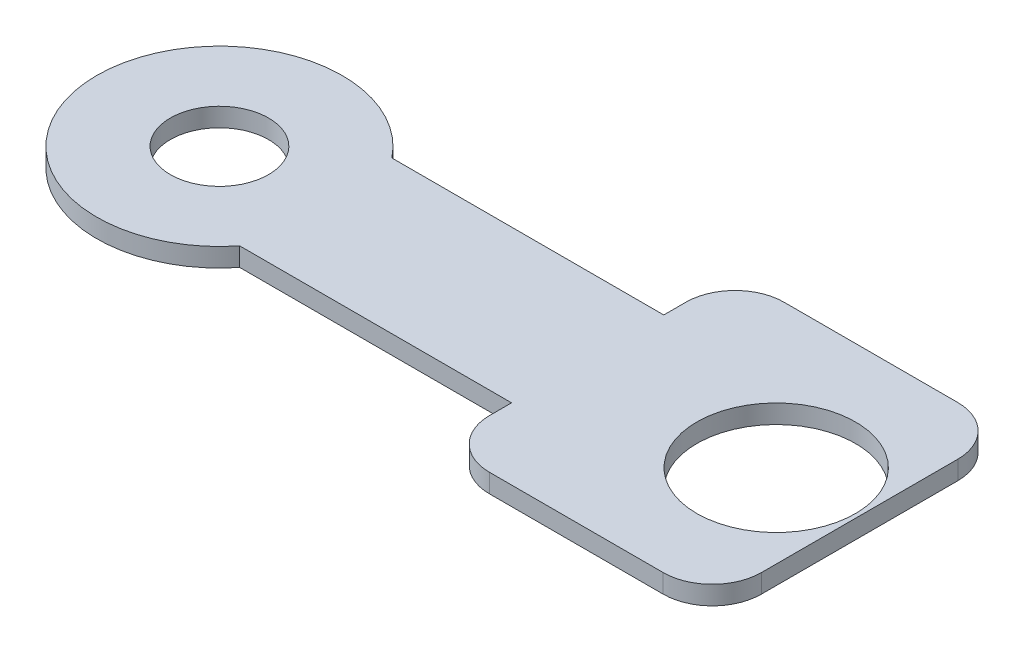
ISO-10303-21;
HEADER;
FILE_DESCRIPTION(('STEP AP214'),'2;1');
FILE_NAME('part.step','',(''),(''),'','','');
FILE_SCHEMA(('AUTOMOTIVE_DESIGN { 1 0 10303 214 1 1 1 1 }'));
ENDSEC;
DATA;
#1=APPLICATION_CONTEXT('core data for automotive mechanical design processes');
#2=APPLICATION_PROTOCOL_DEFINITION('international standard','automotive_design',2000,#1);
#3=PRODUCT_CONTEXT('',#1,'mechanical');
#4=PRODUCT('Part','Part','',(#3));
#5=PRODUCT_RELATED_PRODUCT_CATEGORY('part','',(#4));
#6=PRODUCT_DEFINITION_FORMATION('','',#4);
#7=PRODUCT_DEFINITION_CONTEXT('part definition',#1,'design');
#8=PRODUCT_DEFINITION('design','',#6,#7);
#9=PRODUCT_DEFINITION_SHAPE('','',#8);
#10=(LENGTH_UNIT() NAMED_UNIT(*) SI_UNIT(.MILLI.,.METRE.));
#11=(NAMED_UNIT(*) PLANE_ANGLE_UNIT() SI_UNIT($,.RADIAN.));
#12=(NAMED_UNIT(*) SI_UNIT($,.STERADIAN.) SOLID_ANGLE_UNIT());
#13=UNCERTAINTY_MEASURE_WITH_UNIT(LENGTH_MEASURE(1.E-05),#10,'distance_accuracy_value','');
#14=(GEOMETRIC_REPRESENTATION_CONTEXT(3) GLOBAL_UNCERTAINTY_ASSIGNED_CONTEXT((#13)) GLOBAL_UNIT_ASSIGNED_CONTEXT((#10,
#11,#12)) REPRESENTATION_CONTEXT('',''));
#15=CARTESIAN_POINT('',(0.,0.,0.));
#16=DIRECTION('',(0.,0.,1.));
#17=DIRECTION('',(1.,0.,0.));
#18=AXIS2_PLACEMENT_3D('',#15,#16,#17);
#19=CARTESIAN_POINT('',(0.,0.381,-1.55));
#20=DIRECTION('',(0.,0.,1.));
#21=DIRECTION('',(1.,0.,0.));
#22=AXIS2_PLACEMENT_3D('',#19,#20,#21);
#23=PLANE('',#22);
#24=DIRECTION('',(-1.,0.,0.));
#25=VECTOR('',#24,1.);
#26=CARTESIAN_POINT('',(0.,0.,-1.55));
#27=LINE('',#26,#25);
#28=CARTESIAN_POINT('',(10.,0.,-1.55));
#29=VERTEX_POINT('',#28);
#30=CARTESIAN_POINT('',(4.4615045245933,0.,-1.55));
#31=VERTEX_POINT('',#30);
#32=EDGE_CURVE('E165',#29,#31,#27,.T.);
#33=ORIENTED_EDGE('',*,*,#32,.T.);
#34=DIRECTION('',(0.,-1.,0.));
#35=VECTOR('',#34,1.);
#36=CARTESIAN_POINT('',(4.4615045245933,0.381,-1.55));
#37=LINE('',#36,#35);
#38=CARTESIAN_POINT('',(4.4615045245933,0.381,-1.55));
#39=VERTEX_POINT('',#38);
#40=EDGE_CURVE('E11',#39,#31,#37,.T.);
#41=ORIENTED_EDGE('',*,*,#40,.F.);
#42=DIRECTION('',(-1.,0.,0.));
#43=VECTOR('',#42,1.);
#44=CARTESIAN_POINT('',(0.,0.381,-1.55));
#45=LINE('',#44,#43);
#46=CARTESIAN_POINT('',(10.,0.381,-1.55));
#47=VERTEX_POINT('',#46);
#48=EDGE_CURVE('E234',#47,#39,#45,.T.);
#49=ORIENTED_EDGE('',*,*,#48,.F.);
#50=DIRECTION('',(0.,-1.,0.));
#51=VECTOR('',#50,1.);
#52=CARTESIAN_POINT('',(10.,0.381,-1.55));
#53=LINE('',#52,#51);
#54=EDGE_CURVE('E53',#47,#29,#53,.T.);
#55=ORIENTED_EDGE('',*,*,#54,.T.);
#56=EDGE_LOOP('',(#33,#41,#49,#55));
#57=FACE_BOUND('',#56,.T.);
#58=ADVANCED_FACE('F36',(#57),#23,.F.);
#59=CARTESIAN_POINT('',(2.5,0.381,0.));
#60=DIRECTION('',(0.,-1.,0.));
#61=DIRECTION('',(0.,0.,-1.));
#62=AXIS2_PLACEMENT_3D('',#59,#60,#61);
#63=CYLINDRICAL_SURFACE('',#62,2.5);
#64=CARTESIAN_POINT('',(2.5,0.,0.));
#65=DIRECTION('',(0.,1.,0.));
#66=DIRECTION('',(0.,0.,1.));
#67=AXIS2_PLACEMENT_3D('',#64,#65,#66);
#68=CIRCLE('',#67,2.5);
#69=CARTESIAN_POINT('',(4.4615045245933,0.,1.55));
#70=VERTEX_POINT('',#69);
#71=EDGE_CURVE('E167',#31,#70,#68,.T.);
#72=ORIENTED_EDGE('',*,*,#71,.T.);
#73=DIRECTION('',(0.,-1.,0.));
#74=VECTOR('',#73,1.);
#75=CARTESIAN_POINT('',(4.4615045245933,0.381,1.55));
#76=LINE('',#75,#74);
#77=CARTESIAN_POINT('',(4.4615045245933,0.381,1.55));
#78=VERTEX_POINT('',#77);
#79=EDGE_CURVE('E45',#78,#70,#76,.T.);
#80=ORIENTED_EDGE('',*,*,#79,.F.);
#81=CARTESIAN_POINT('',(2.5,0.381,0.));
#82=DIRECTION('',(0.,1.,0.));
#83=DIRECTION('',(0.,0.,1.));
#84=AXIS2_PLACEMENT_3D('',#81,#82,#83);
#85=CIRCLE('',#84,2.5);
#86=EDGE_CURVE('E103',#39,#78,#85,.T.);
#87=ORIENTED_EDGE('',*,*,#86,.F.);
#88=ORIENTED_EDGE('',*,*,#40,.T.);
#89=EDGE_LOOP('',(#72,#80,#87,#88));
#90=FACE_BOUND('',#89,.T.);
#91=ADVANCED_FACE('F219',(#90),#63,.T.);
#92=CARTESIAN_POINT('',(0.,0.381,1.55));
#93=DIRECTION('',(0.,0.,1.));
#94=DIRECTION('',(1.,0.,0.));
#95=AXIS2_PLACEMENT_3D('',#92,#93,#94);
#96=PLANE('',#95);
#97=DIRECTION('',(-1.,0.,0.));
#98=VECTOR('',#97,1.);
#99=CARTESIAN_POINT('',(0.,0.,1.55));
#100=LINE('',#99,#98);
#101=CARTESIAN_POINT('',(10.,0.,1.55));
#102=VERTEX_POINT('',#101);
#103=EDGE_CURVE('E170',#102,#70,#100,.T.);
#104=ORIENTED_EDGE('',*,*,#103,.F.);
#105=DIRECTION('',(0.,-1.,0.));
#106=VECTOR('',#105,1.);
#107=CARTESIAN_POINT('',(10.,0.381,1.55));
#108=LINE('',#107,#106);
#109=CARTESIAN_POINT('',(10.,0.381,1.55));
#110=VERTEX_POINT('',#109);
#111=EDGE_CURVE('E212',#110,#102,#108,.T.);
#112=ORIENTED_EDGE('',*,*,#111,.F.);
#113=DIRECTION('',(-1.,0.,0.));
#114=VECTOR('',#113,1.);
#115=CARTESIAN_POINT('',(0.,0.381,1.55));
#116=LINE('',#115,#114);
#117=EDGE_CURVE('E218',#110,#78,#116,.T.);
#118=ORIENTED_EDGE('',*,*,#117,.T.);
#119=ORIENTED_EDGE('',*,*,#79,.T.);
#120=EDGE_LOOP('',(#104,#112,#118,#119));
#121=FACE_BOUND('',#120,.T.);
#122=ADVANCED_FACE('F216',(#121),#96,.T.);
#123=CARTESIAN_POINT('',(10.,0.381,0.));
#124=DIRECTION('',(-1.,0.,0.));
#125=DIRECTION('',(0.,0.,1.));
#126=AXIS2_PLACEMENT_3D('',#123,#124,#125);
#127=PLANE('',#126);
#128=DIRECTION('',(0.,0.,-1.));
#129=VECTOR('',#128,1.);
#130=CARTESIAN_POINT('',(10.,0.,0.));
#131=LINE('',#130,#129);
#132=CARTESIAN_POINT('',(10.,0.,1.99999999999999));
#133=VERTEX_POINT('',#132);
#134=EDGE_CURVE('E173',#133,#102,#131,.T.);
#135=ORIENTED_EDGE('',*,*,#134,.F.);
#136=DIRECTION('',(0.,-1.,0.));
#137=VECTOR('',#136,1.);
#138=CARTESIAN_POINT('',(10.,0.381,1.99999999999999));
#139=LINE('',#138,#137);
#140=CARTESIAN_POINT('',(10.,0.381,1.99999999999999));
#141=VERTEX_POINT('',#140);
#142=EDGE_CURVE('E210',#141,#133,#139,.T.);
#143=ORIENTED_EDGE('',*,*,#142,.F.);
#144=DIRECTION('',(0.,0.,-1.));
#145=VECTOR('',#144,1.);
#146=CARTESIAN_POINT('',(10.,0.381,0.));
#147=LINE('',#146,#145);
#148=EDGE_CURVE('E157',#141,#110,#147,.T.);
#149=ORIENTED_EDGE('',*,*,#148,.T.);
#150=ORIENTED_EDGE('',*,*,#111,.T.);
#151=EDGE_LOOP('',(#135,#143,#149,#150));
#152=FACE_BOUND('',#151,.T.);
#153=ADVANCED_FACE('F228',(#152),#127,.T.);
#154=CARTESIAN_POINT('',(11.,0.381,2.));
#155=DIRECTION('',(0.,-1.,0.));
#156=DIRECTION('',(0.,0.,-1.));
#157=AXIS2_PLACEMENT_3D('',#154,#155,#156);
#158=CYLINDRICAL_SURFACE('',#157,1.);
#159=CARTESIAN_POINT('',(11.,0.,2.));
#160=DIRECTION('',(0.,1.,0.));
#161=DIRECTION('',(0.,0.,1.));
#162=AXIS2_PLACEMENT_3D('',#159,#160,#161);
#163=CIRCLE('',#162,1.);
#164=CARTESIAN_POINT('',(11.,0.,3.));
#165=VERTEX_POINT('',#164);
#166=EDGE_CURVE('E176',#133,#165,#163,.T.);
#167=ORIENTED_EDGE('',*,*,#166,.T.);
#168=DIRECTION('',(0.,-1.,0.));
#169=VECTOR('',#168,1.);
#170=CARTESIAN_POINT('',(11.,0.381,3.));
#171=LINE('',#170,#169);
#172=CARTESIAN_POINT('',(11.,0.381,3.));
#173=VERTEX_POINT('',#172);
#174=EDGE_CURVE('E207',#173,#165,#171,.T.);
#175=ORIENTED_EDGE('',*,*,#174,.F.);
#176=CARTESIAN_POINT('',(11.,0.381,2.));
#177=DIRECTION('',(0.,1.,0.));
#178=DIRECTION('',(0.,0.,1.));
#179=AXIS2_PLACEMENT_3D('',#176,#177,#178);
#180=CIRCLE('',#179,1.);
#181=EDGE_CURVE('E233',#141,#173,#180,.T.);
#182=ORIENTED_EDGE('',*,*,#181,.F.);
#183=ORIENTED_EDGE('',*,*,#142,.T.);
#184=EDGE_LOOP('',(#167,#175,#182,#183));
#185=FACE_BOUND('',#184,.T.);
#186=ADVANCED_FACE('F267',(#185),#158,.T.);
#187=CARTESIAN_POINT('',(0.,0.381,3.));
#188=DIRECTION('',(0.,0.,-1.));
#189=DIRECTION('',(-1.,0.,0.));
#190=AXIS2_PLACEMENT_3D('',#187,#188,#189);
#191=PLANE('',#190);
#192=DIRECTION('',(1.,0.,0.));
#193=VECTOR('',#192,1.);
#194=CARTESIAN_POINT('',(0.,0.,3.));
#195=LINE('',#194,#193);
#196=CARTESIAN_POINT('',(14.5384954754067,0.,3.));
#197=VERTEX_POINT('',#196);
#198=EDGE_CURVE('E179',#165,#197,#195,.T.);
#199=ORIENTED_EDGE('',*,*,#198,.T.);
#200=DIRECTION('',(0.,-1.,0.));
#201=VECTOR('',#200,1.);
#202=CARTESIAN_POINT('',(14.5384954754067,0.381,3.));
#203=LINE('',#202,#201);
#204=CARTESIAN_POINT('',(14.5384954754067,0.381,3.));
#205=VERTEX_POINT('',#204);
#206=EDGE_CURVE('E205',#205,#197,#203,.T.);
#207=ORIENTED_EDGE('',*,*,#206,.F.);
#208=DIRECTION('',(1.,0.,0.));
#209=VECTOR('',#208,1.);
#210=CARTESIAN_POINT('',(0.,0.381,3.));
#211=LINE('',#210,#209);
#212=EDGE_CURVE('E239',#173,#205,#211,.T.);
#213=ORIENTED_EDGE('',*,*,#212,.F.);
#214=ORIENTED_EDGE('',*,*,#174,.T.);
#215=EDGE_LOOP('',(#199,#207,#213,#214));
#216=FACE_BOUND('',#215,.T.);
#217=ADVANCED_FACE('F278',(#216),#191,.F.);
#218=CARTESIAN_POINT('',(14.5384954754067,0.381,2.));
#219=DIRECTION('',(0.,-1.,0.));
#220=DIRECTION('',(0.,0.,-1.));
#221=AXIS2_PLACEMENT_3D('',#218,#219,#220);
#222=CYLINDRICAL_SURFACE('',#221,1.);
#223=CARTESIAN_POINT('',(14.5384954754067,0.,2.));
#224=DIRECTION('',(0.,1.,0.));
#225=DIRECTION('',(0.,0.,1.));
#226=AXIS2_PLACEMENT_3D('',#223,#224,#225);
#227=CIRCLE('',#226,1.);
#228=CARTESIAN_POINT('',(15.5384954754067,0.,1.99999999999999));
#229=VERTEX_POINT('',#228);
#230=EDGE_CURVE('E182',#229,#197,#227,.F.);
#231=ORIENTED_EDGE('',*,*,#230,.F.);
#232=DIRECTION('',(0.,-1.,0.));
#233=VECTOR('',#232,1.);
#234=CARTESIAN_POINT('',(15.5384954754067,0.381,1.99999999999999));
#235=LINE('',#234,#233);
#236=CARTESIAN_POINT('',(15.5384954754067,0.381,1.99999999999999));
#237=VERTEX_POINT('',#236);
#238=EDGE_CURVE('E203',#237,#229,#235,.T.);
#239=ORIENTED_EDGE('',*,*,#238,.F.);
#240=CARTESIAN_POINT('',(14.5384954754067,0.381,2.));
#241=DIRECTION('',(0.,1.,0.));
#242=DIRECTION('',(0.,0.,1.));
#243=AXIS2_PLACEMENT_3D('',#240,#241,#242);
#244=CIRCLE('',#243,1.);
#245=EDGE_CURVE('E241',#237,#205,#244,.F.);
#246=ORIENTED_EDGE('',*,*,#245,.T.);
#247=ORIENTED_EDGE('',*,*,#206,.T.);
#248=EDGE_LOOP('',(#231,#239,#246,#247));
#249=FACE_BOUND('',#248,.T.);
#250=ADVANCED_FACE('F282',(#249),#222,.T.);
#251=CARTESIAN_POINT('',(15.5384954754067,0.381,0.));
#252=DIRECTION('',(-1.,0.,0.));
#253=DIRECTION('',(0.,0.,1.));
#254=AXIS2_PLACEMENT_3D('',#251,#252,#253);
#255=PLANE('',#254);
#256=DIRECTION('',(0.,0.,-1.));
#257=VECTOR('',#256,1.);
#258=CARTESIAN_POINT('',(15.5384954754067,0.,0.));
#259=LINE('',#258,#257);
#260=CARTESIAN_POINT('',(15.5384954754067,0.,-1.99999999999999));
#261=VERTEX_POINT('',#260);
#262=EDGE_CURVE('E185',#229,#261,#259,.T.);
#263=ORIENTED_EDGE('',*,*,#262,.T.);
#264=DIRECTION('',(0.,-1.,0.));
#265=VECTOR('',#264,1.);
#266=CARTESIAN_POINT('',(15.5384954754067,0.381,-1.99999999999999));
#267=LINE('',#266,#265);
#268=CARTESIAN_POINT('',(15.5384954754067,0.381,-1.99999999999999));
#269=VERTEX_POINT('',#268);
#270=EDGE_CURVE('E200',#269,#261,#267,.T.);
#271=ORIENTED_EDGE('',*,*,#270,.F.);
#272=DIRECTION('',(0.,0.,-1.));
#273=VECTOR('',#272,1.);
#274=CARTESIAN_POINT('',(15.5384954754067,0.381,0.));
#275=LINE('',#274,#273);
#276=EDGE_CURVE('E244',#237,#269,#275,.T.);
#277=ORIENTED_EDGE('',*,*,#276,.F.);
#278=ORIENTED_EDGE('',*,*,#238,.T.);
#279=EDGE_LOOP('',(#263,#271,#277,#278));
#280=FACE_BOUND('',#279,.T.);
#281=ADVANCED_FACE('F249',(#280),#255,.F.);
#282=CARTESIAN_POINT('',(14.5384954754067,0.381,-2.));
#283=DIRECTION('',(0.,-1.,0.));
#284=DIRECTION('',(0.,0.,-1.));
#285=AXIS2_PLACEMENT_3D('',#282,#283,#284);
#286=CYLINDRICAL_SURFACE('',#285,1.);
#287=CARTESIAN_POINT('',(14.5384954754067,0.,-2.));
#288=DIRECTION('',(0.,1.,0.));
#289=DIRECTION('',(0.,0.,1.));
#290=AXIS2_PLACEMENT_3D('',#287,#288,#289);
#291=CIRCLE('',#290,1.);
#292=CARTESIAN_POINT('',(14.5384954754067,0.,-3.));
#293=VERTEX_POINT('',#292);
#294=EDGE_CURVE('E187',#261,#293,#291,.T.);
#295=ORIENTED_EDGE('',*,*,#294,.T.);
#296=DIRECTION('',(0.,-1.,0.));
#297=VECTOR('',#296,1.);
#298=CARTESIAN_POINT('',(14.5384954754067,0.381,-3.));
#299=LINE('',#298,#297);
#300=CARTESIAN_POINT('',(14.5384954754067,0.381,-3.));
#301=VERTEX_POINT('',#300);
#302=EDGE_CURVE('E140',#301,#293,#299,.T.);
#303=ORIENTED_EDGE('',*,*,#302,.F.);
#304=CARTESIAN_POINT('',(14.5384954754067,0.381,-2.));
#305=DIRECTION('',(0.,1.,0.));
#306=DIRECTION('',(0.,0.,1.));
#307=AXIS2_PLACEMENT_3D('',#304,#305,#306);
#308=CIRCLE('',#307,1.);
#309=EDGE_CURVE('E149',#269,#301,#308,.T.);
#310=ORIENTED_EDGE('',*,*,#309,.F.);
#311=ORIENTED_EDGE('',*,*,#270,.T.);
#312=EDGE_LOOP('',(#295,#303,#310,#311));
#313=FACE_BOUND('',#312,.T.);
#314=ADVANCED_FACE('F253',(#313),#286,.T.);
#315=CARTESIAN_POINT('',(0.,0.381,-3.));
#316=DIRECTION('',(0.,0.,-1.));
#317=DIRECTION('',(-1.,0.,0.));
#318=AXIS2_PLACEMENT_3D('',#315,#316,#317);
#319=PLANE('',#318);
#320=DIRECTION('',(1.,0.,0.));
#321=VECTOR('',#320,1.);
#322=CARTESIAN_POINT('',(0.,0.,-3.));
#323=LINE('',#322,#321);
#324=CARTESIAN_POINT('',(11.,0.,-3.));
#325=VERTEX_POINT('',#324);
#326=EDGE_CURVE('E136',#325,#293,#323,.T.);
#327=ORIENTED_EDGE('',*,*,#326,.F.);
#328=DIRECTION('',(0.,-1.,0.));
#329=VECTOR('',#328,1.);
#330=CARTESIAN_POINT('',(11.,0.381,-3.));
#331=LINE('',#330,#329);
#332=CARTESIAN_POINT('',(11.,0.381,-3.));
#333=VERTEX_POINT('',#332);
#334=EDGE_CURVE('E131',#333,#325,#331,.T.);
#335=ORIENTED_EDGE('',*,*,#334,.F.);
#336=DIRECTION('',(1.,0.,0.));
#337=VECTOR('',#336,1.);
#338=CARTESIAN_POINT('',(0.,0.381,-3.));
#339=LINE('',#338,#337);
#340=EDGE_CURVE('E134',#333,#301,#339,.T.);
#341=ORIENTED_EDGE('',*,*,#340,.T.);
#342=ORIENTED_EDGE('',*,*,#302,.T.);
#343=EDGE_LOOP('',(#327,#335,#341,#342));
#344=FACE_BOUND('',#343,.T.);
#345=ADVANCED_FACE('F133',(#344),#319,.T.);
#346=CARTESIAN_POINT('',(11.,0.381,-2.));
#347=DIRECTION('',(0.,-1.,0.));
#348=DIRECTION('',(0.,0.,-1.));
#349=AXIS2_PLACEMENT_3D('',#346,#347,#348);
#350=CYLINDRICAL_SURFACE('',#349,1.);
#351=CARTESIAN_POINT('',(11.,0.,-2.));
#352=DIRECTION('',(0.,1.,0.));
#353=DIRECTION('',(0.,0.,1.));
#354=AXIS2_PLACEMENT_3D('',#351,#352,#353);
#355=CIRCLE('',#354,1.);
#356=CARTESIAN_POINT('',(10.,0.,-1.99999999999999));
#357=VERTEX_POINT('',#356);
#358=EDGE_CURVE('E191',#357,#325,#355,.F.);
#359=ORIENTED_EDGE('',*,*,#358,.F.);
#360=DIRECTION('',(0.,-1.,0.));
#361=VECTOR('',#360,1.);
#362=CARTESIAN_POINT('',(10.,0.381,-1.99999999999999));
#363=LINE('',#362,#361);
#364=CARTESIAN_POINT('',(10.,0.381,-1.99999999999999));
#365=VERTEX_POINT('',#364);
#366=EDGE_CURVE('E91',#365,#357,#363,.T.);
#367=ORIENTED_EDGE('',*,*,#366,.F.);
#368=CARTESIAN_POINT('',(11.,0.381,-2.));
#369=DIRECTION('',(0.,1.,0.));
#370=DIRECTION('',(0.,0.,1.));
#371=AXIS2_PLACEMENT_3D('',#368,#369,#370);
#372=CIRCLE('',#371,1.);
#373=EDGE_CURVE('E147',#365,#333,#372,.F.);
#374=ORIENTED_EDGE('',*,*,#373,.T.);
#375=ORIENTED_EDGE('',*,*,#334,.T.);
#376=EDGE_LOOP('',(#359,#367,#374,#375));
#377=FACE_BOUND('',#376,.T.);
#378=ADVANCED_FACE('F152',(#377),#350,.T.);
#379=EDGE_CURVE('E177',#29,#357,#131,.T.);
#380=ORIENTED_EDGE('',*,*,#379,.F.);
#381=ORIENTED_EDGE('',*,*,#54,.F.);
#382=EDGE_CURVE('E153',#47,#365,#147,.T.);
#383=ORIENTED_EDGE('',*,*,#382,.T.);
#384=ORIENTED_EDGE('',*,*,#366,.T.);
#385=EDGE_LOOP('',(#380,#381,#383,#384));
#386=FACE_BOUND('',#385,.T.);
#387=ADVANCED_FACE('F255',(#386),#127,.T.);
#388=CARTESIAN_POINT('',(2.5,0.381,0.));
#389=DIRECTION('',(0.,-1.,0.));
#390=DIRECTION('',(0.,0.,-1.));
#391=AXIS2_PLACEMENT_3D('',#388,#389,#390);
#392=CYLINDRICAL_SURFACE('',#391,1.);
#393=CARTESIAN_POINT('',(2.5,0.381,0.));
#394=DIRECTION('',(0.,1.,0.));
#395=DIRECTION('',(0.,0.,1.));
#396=AXIS2_PLACEMENT_3D('',#393,#394,#395);
#397=CIRCLE('',#396,1.);
#398=CARTESIAN_POINT('',(2.5,0.381,1.));
#399=VERTEX_POINT('',#398);
#400=EDGE_CURVE('E196',#399,#399,#397,.T.);
#401=ORIENTED_EDGE('',*,*,#400,.T.);
#402=EDGE_LOOP('',(#401));
#403=FACE_BOUND('',#402,.T.);
#404=CARTESIAN_POINT('',(2.5,0.,0.));
#405=DIRECTION('',(0.,1.,0.));
#406=DIRECTION('',(0.,0.,1.));
#407=AXIS2_PLACEMENT_3D('',#404,#405,#406);
#408=CIRCLE('',#407,1.);
#409=CARTESIAN_POINT('',(2.5,0.,1.));
#410=VERTEX_POINT('',#409);
#411=EDGE_CURVE('E162',#410,#410,#408,.T.);
#412=ORIENTED_EDGE('',*,*,#411,.F.);
#413=EDGE_LOOP('',(#412));
#414=FACE_BOUND('',#413,.T.);
#415=ADVANCED_FACE('F38',(#403,#414),#392,.F.);
#416=CARTESIAN_POINT('',(13.8396575459696,0.381,0.));
#417=DIRECTION('',(0.,-1.,0.));
#418=DIRECTION('',(0.,0.,-1.));
#419=AXIS2_PLACEMENT_3D('',#416,#417,#418);
#420=CYLINDRICAL_SURFACE('',#419,1.61643912523543);
#421=CARTESIAN_POINT('',(13.8396575459696,0.381,0.));
#422=DIRECTION('',(0.,1.,0.));
#423=DIRECTION('',(0.,0.,1.));
#424=AXIS2_PLACEMENT_3D('',#421,#422,#423);
#425=CIRCLE('',#424,1.61643912523543);
#426=CARTESIAN_POINT('',(13.8396575459696,0.381,1.61643912523543));
#427=VERTEX_POINT('',#426);
#428=EDGE_CURVE('E155',#427,#427,#425,.T.);
#429=ORIENTED_EDGE('',*,*,#428,.T.);
#430=EDGE_LOOP('',(#429));
#431=FACE_BOUND('',#430,.T.);
#432=CARTESIAN_POINT('',(13.8396575459696,0.,0.));
#433=DIRECTION('',(0.,1.,0.));
#434=DIRECTION('',(0.,0.,1.));
#435=AXIS2_PLACEMENT_3D('',#432,#433,#434);
#436=CIRCLE('',#435,1.61643912523543);
#437=CARTESIAN_POINT('',(13.8396575459696,0.,1.61643912523543));
#438=VERTEX_POINT('',#437);
#439=EDGE_CURVE('E193',#438,#438,#436,.T.);
#440=ORIENTED_EDGE('',*,*,#439,.F.);
#441=EDGE_LOOP('',(#440));
#442=FACE_BOUND('',#441,.T.);
#443=ADVANCED_FACE('F262',(#431,#442),#420,.F.);
#444=CARTESIAN_POINT('',(0.,0.381,0.));
#445=DIRECTION('',(0.,1.,0.));
#446=DIRECTION('',(0.,0.,1.));
#447=AXIS2_PLACEMENT_3D('',#444,#445,#446);
#448=PLANE('',#447);
#449=ORIENTED_EDGE('',*,*,#400,.F.);
#450=EDGE_LOOP('',(#449));
#451=FACE_BOUND('',#450,.T.);
#452=ORIENTED_EDGE('',*,*,#48,.T.);
#453=ORIENTED_EDGE('',*,*,#86,.T.);
#454=ORIENTED_EDGE('',*,*,#117,.F.);
#455=ORIENTED_EDGE('',*,*,#148,.F.);
#456=ORIENTED_EDGE('',*,*,#181,.T.);
#457=ORIENTED_EDGE('',*,*,#212,.T.);
#458=ORIENTED_EDGE('',*,*,#245,.F.);
#459=ORIENTED_EDGE('',*,*,#276,.T.);
#460=ORIENTED_EDGE('',*,*,#309,.T.);
#461=ORIENTED_EDGE('',*,*,#340,.F.);
#462=ORIENTED_EDGE('',*,*,#373,.F.);
#463=ORIENTED_EDGE('',*,*,#382,.F.);
#464=EDGE_LOOP('',(#452,#453,#454,#455,#456,#457,#458,#459,#460,#461,#462,#463));
#465=FACE_BOUND('',#464,.T.);
#466=ORIENTED_EDGE('',*,*,#428,.F.);
#467=EDGE_LOOP('',(#466));
#468=FACE_BOUND('',#467,.T.);
#469=ADVANCED_FACE('F144',(#451,#465,#468),#448,.T.);
#470=CARTESIAN_POINT('',(0.,0.,0.));
#471=DIRECTION('',(0.,1.,0.));
#472=DIRECTION('',(0.,0.,1.));
#473=AXIS2_PLACEMENT_3D('',#470,#471,#472);
#474=PLANE('',#473);
#475=ORIENTED_EDGE('',*,*,#411,.T.);
#476=EDGE_LOOP('',(#475));
#477=FACE_BOUND('',#476,.T.);
#478=ORIENTED_EDGE('',*,*,#32,.F.);
#479=ORIENTED_EDGE('',*,*,#379,.T.);
#480=ORIENTED_EDGE('',*,*,#358,.T.);
#481=ORIENTED_EDGE('',*,*,#326,.T.);
#482=ORIENTED_EDGE('',*,*,#294,.F.);
#483=ORIENTED_EDGE('',*,*,#262,.F.);
#484=ORIENTED_EDGE('',*,*,#230,.T.);
#485=ORIENTED_EDGE('',*,*,#198,.F.);
#486=ORIENTED_EDGE('',*,*,#166,.F.);
#487=ORIENTED_EDGE('',*,*,#134,.T.);
#488=ORIENTED_EDGE('',*,*,#103,.T.);
#489=ORIENTED_EDGE('',*,*,#71,.F.);
#490=EDGE_LOOP('',(#478,#479,#480,#481,#482,#483,#484,#485,#486,#487,#488,#489));
#491=FACE_BOUND('',#490,.T.);
#492=ORIENTED_EDGE('',*,*,#439,.T.);
#493=EDGE_LOOP('',(#492));
#494=FACE_BOUND('',#493,.T.);
#495=ADVANCED_FACE('F222',(#477,#491,#494),#474,.F.);
#496=CLOSED_SHELL('',(#58,#91,#122,#153,#186,#217,#250,#281,#314,#345,#378,#387,#415,#443,#469,#495));
#497=MANIFOLD_SOLID_BREP('B2',#496);
#498=ADVANCED_BREP_SHAPE_REPRESENTATION('',(#18,#497),#14);
#499=SHAPE_DEFINITION_REPRESENTATION(#9,#498);
ENDSEC;
END-ISO-10303-21;
